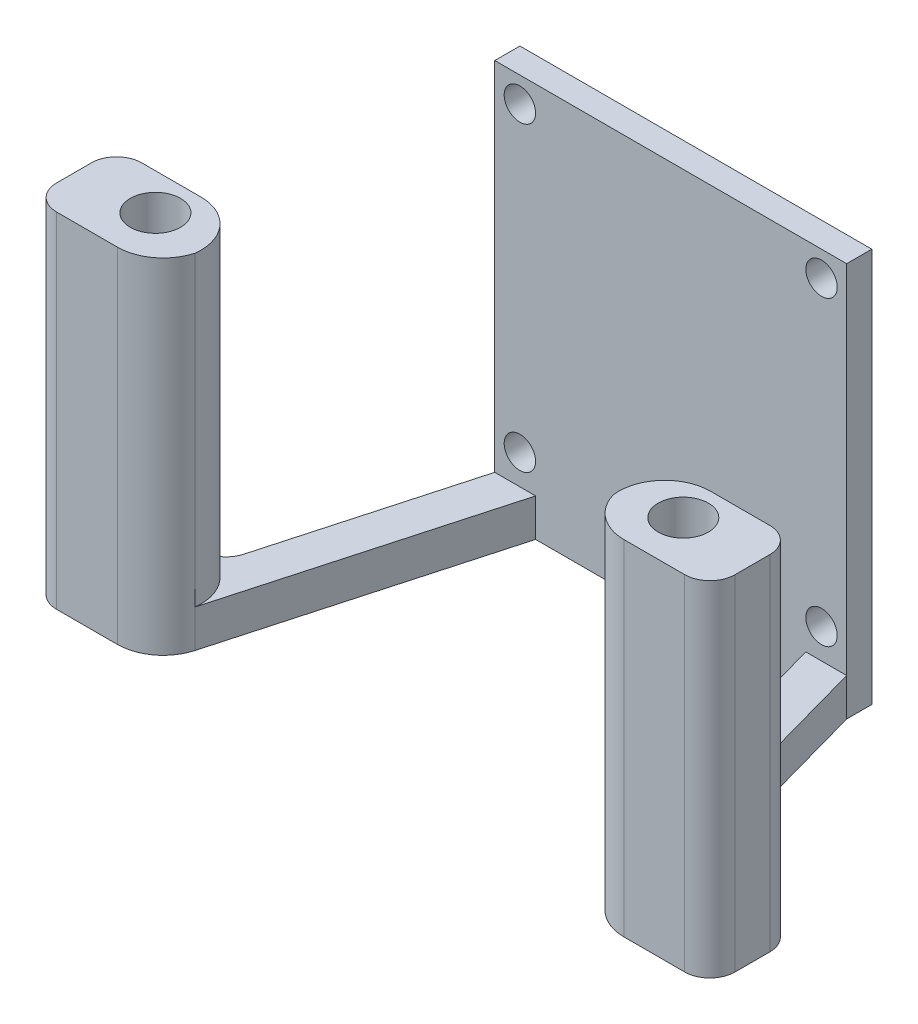
ISO-10303-21;
HEADER;
FILE_DESCRIPTION(('STEP AP214'),'2;1');
FILE_NAME('part.step','',(''),(''),'','','');
FILE_SCHEMA(('AUTOMOTIVE_DESIGN { 1 0 10303 214 1 1 1 1 }'));
ENDSEC;
DATA;
#1=APPLICATION_CONTEXT('core data for automotive mechanical design processes');
#2=APPLICATION_PROTOCOL_DEFINITION('international standard','automotive_design',2000,#1);
#3=PRODUCT_CONTEXT('',#1,'mechanical');
#4=PRODUCT('Part','Part','',(#3));
#5=PRODUCT_RELATED_PRODUCT_CATEGORY('part','',(#4));
#6=PRODUCT_DEFINITION_FORMATION('','',#4);
#7=PRODUCT_DEFINITION_CONTEXT('part definition',#1,'design');
#8=PRODUCT_DEFINITION('design','',#6,#7);
#9=PRODUCT_DEFINITION_SHAPE('','',#8);
#10=(LENGTH_UNIT() NAMED_UNIT(*) SI_UNIT(.MILLI.,.METRE.));
#11=(NAMED_UNIT(*) PLANE_ANGLE_UNIT() SI_UNIT($,.RADIAN.));
#12=(NAMED_UNIT(*) SI_UNIT($,.STERADIAN.) SOLID_ANGLE_UNIT());
#13=UNCERTAINTY_MEASURE_WITH_UNIT(LENGTH_MEASURE(1.E-05),#10,'distance_accuracy_value','');
#14=(GEOMETRIC_REPRESENTATION_CONTEXT(3) GLOBAL_UNCERTAINTY_ASSIGNED_CONTEXT((#13)) GLOBAL_UNIT_ASSIGNED_CONTEXT((#10,
#11,#12)) REPRESENTATION_CONTEXT('',''));
#15=CARTESIAN_POINT('',(0.,0.,0.));
#16=DIRECTION('',(0.,0.,1.));
#17=DIRECTION('',(1.,0.,0.));
#18=AXIS2_PLACEMENT_3D('',#15,#16,#17);
#19=CARTESIAN_POINT('',(20.2723691911253,-14.3761985054046,19.0980908828696));
#20=DIRECTION('',(0.,-1.,0.));
#21=DIRECTION('',(0.,0.,-1.));
#22=AXIS2_PLACEMENT_3D('',#19,#20,#21);
#23=PLANE('',#22);
#24=CARTESIAN_POINT('',(20.2723691911253,-14.3761985054046,24.7551831400172));
#25=DIRECTION('',(0.,-1.,0.));
#26=DIRECTION('',(0.,0.,1.));
#27=AXIS2_PLACEMENT_3D('',#24,#25,#26);
#28=CIRCLE('',#27,3.65709225714755);
#29=CARTESIAN_POINT('',(20.2723691911253,-14.3761985054046,21.0980908828696));
#30=VERTEX_POINT('',#29);
#31=CARTESIAN_POINT('',(16.6423044998491,-14.3761985054046,25.1989782666676));
#32=VERTEX_POINT('',#31);
#33=EDGE_CURVE('E893',#30,#32,#28,.F.);
#34=ORIENTED_EDGE('',*,*,#33,.F.);
#35=CARTESIAN_POINT('',(20.2723691911253,-14.3761985054046,19.0980908828696));
#36=DIRECTION('',(0.,1.,0.));
#37=DIRECTION('',(0.,0.,-1.));
#38=AXIS2_PLACEMENT_3D('',#35,#36,#37);
#39=CIRCLE('',#38,2.);
#40=CARTESIAN_POINT('',(18.3454201146444,-14.3761985054046,19.6336907863886));
#41=VERTEX_POINT('',#40);
#42=EDGE_CURVE('E783',#41,#30,#39,.T.);
#43=ORIENTED_EDGE('',*,*,#42,.F.);
#44=DIRECTION('',(0.267799951759495,0.,0.963474538240431));
#45=VECTOR('',#44,1.);
#46=CARTESIAN_POINT('',(14.,-14.3761985054046,4.));
#47=LINE('',#46,#45);
#48=CARTESIAN_POINT('',(14.,-14.3761985054046,4.));
#49=VERTEX_POINT('',#48);
#50=EDGE_CURVE('E773',#49,#41,#47,.T.);
#51=ORIENTED_EDGE('',*,*,#50,.F.);
#52=DIRECTION('',(1.,0.,0.));
#53=VECTOR('',#52,1.);
#54=CARTESIAN_POINT('',(10.75,-14.3761985054046,4.));
#55=LINE('',#54,#53);
#56=CARTESIAN_POINT('',(10.75,-14.3761985054046,4.));
#57=VERTEX_POINT('',#56);
#58=EDGE_CURVE('E776',#57,#49,#55,.T.);
#59=ORIENTED_EDGE('',*,*,#58,.F.);
#60=DIRECTION('',(-0.267799951759495,0.,-0.963474538240431));
#61=VECTOR('',#60,1.);
#62=CARTESIAN_POINT('',(10.75,-14.3761985054046,4.));
#63=LINE('',#62,#61);
#64=EDGE_CURVE('E851',#32,#57,#63,.T.);
#65=ORIENTED_EDGE('',*,*,#64,.F.);
#66=EDGE_LOOP('',(#34,#43,#51,#59,#65));
#67=FACE_BOUND('',#66,.T.);
#68=ADVANCED_FACE('F37',(#67),#23,.F.);
#69=CARTESIAN_POINT('',(0.,0.,4.));
#70=DIRECTION('',(0.,0.,1.));
#71=DIRECTION('',(1.,0.,0.));
#72=AXIS2_PLACEMENT_3D('',#69,#70,#71);
#73=PLANE('',#72);
#74=DIRECTION('',(0.,-1.,0.));
#75=VECTOR('',#74,1.);
#76=CARTESIAN_POINT('',(10.75,-14.3761985054046,4.));
#77=LINE('',#76,#75);
#78=CARTESIAN_POINT('',(10.75,-17.3761985054046,4.));
#79=VERTEX_POINT('',#78);
#80=EDGE_CURVE('E61',#57,#79,#77,.T.);
#81=ORIENTED_EDGE('',*,*,#80,.F.);
#82=ORIENTED_EDGE('',*,*,#58,.T.);
#83=DIRECTION('',(0.,1.,0.));
#84=VECTOR('',#83,1.);
#85=CARTESIAN_POINT('',(14.,-17.3761985054046,4.));
#86=LINE('',#85,#84);
#87=CARTESIAN_POINT('',(14.,14.,4.));
#88=VERTEX_POINT('',#87);
#89=EDGE_CURVE('E232',#49,#88,#86,.T.);
#90=ORIENTED_EDGE('',*,*,#89,.T.);
#91=DIRECTION('',(-1.,0.,0.));
#92=VECTOR('',#91,1.);
#93=CARTESIAN_POINT('',(14.,14.,4.));
#94=LINE('',#93,#92);
#95=CARTESIAN_POINT('',(-14.,14.,4.));
#96=VERTEX_POINT('',#95);
#97=EDGE_CURVE('E228',#88,#96,#94,.T.);
#98=ORIENTED_EDGE('',*,*,#97,.T.);
#99=DIRECTION('',(0.,-1.,0.));
#100=VECTOR('',#99,1.);
#101=CARTESIAN_POINT('',(-14.,14.,4.));
#102=LINE('',#101,#100);
#103=CARTESIAN_POINT('',(-14.,-14.3761985054046,4.));
#104=VERTEX_POINT('',#103);
#105=EDGE_CURVE('E223',#96,#104,#102,.T.);
#106=ORIENTED_EDGE('',*,*,#105,.T.);
#107=DIRECTION('',(-1.,0.,0.));
#108=VECTOR('',#107,1.);
#109=CARTESIAN_POINT('',(-10.75,-14.3761985054046,4.));
#110=LINE('',#109,#108);
#111=CARTESIAN_POINT('',(-10.75,-14.3761985054046,4.));
#112=VERTEX_POINT('',#111);
#113=EDGE_CURVE('E267',#112,#104,#110,.T.);
#114=ORIENTED_EDGE('',*,*,#113,.F.);
#115=DIRECTION('',(0.,-1.,0.));
#116=VECTOR('',#115,1.);
#117=CARTESIAN_POINT('',(-10.75,-14.3761985054046,4.));
#118=LINE('',#117,#116);
#119=CARTESIAN_POINT('',(-10.75,-17.3761985054046,4.));
#120=VERTEX_POINT('',#119);
#121=EDGE_CURVE('E285',#112,#120,#118,.T.);
#122=ORIENTED_EDGE('',*,*,#121,.T.);
#123=DIRECTION('',(1.,0.,0.));
#124=VECTOR('',#123,1.);
#125=CARTESIAN_POINT('',(-14.,-17.3761985054046,4.));
#126=LINE('',#125,#124);
#127=EDGE_CURVE('E227',#120,#79,#126,.T.);
#128=ORIENTED_EDGE('',*,*,#127,.T.);
#129=EDGE_LOOP('',(#81,#82,#90,#98,#106,#114,#122,#128));
#130=FACE_BOUND('',#129,.T.);
#131=CARTESIAN_POINT('',(12.0000000000001,11.9999999999999,4.));
#132=DIRECTION('',(0.,0.,1.));
#133=DIRECTION('',(1.,0.,0.));
#134=AXIS2_PLACEMENT_3D('',#131,#132,#133);
#135=CIRCLE('',#134,1.24999999999999);
#136=CARTESIAN_POINT('',(13.2500000000001,11.9999999999999,4.));
#137=VERTEX_POINT('',#136);
#138=EDGE_CURVE('E314',#137,#137,#135,.T.);
#139=ORIENTED_EDGE('',*,*,#138,.F.);
#140=EDGE_LOOP('',(#139));
#141=FACE_BOUND('',#140,.T.);
#142=CARTESIAN_POINT('',(-12.,-12.,4.));
#143=DIRECTION('',(0.,0.,1.));
#144=DIRECTION('',(1.,0.,0.));
#145=AXIS2_PLACEMENT_3D('',#142,#143,#144);
#146=CIRCLE('',#145,1.24999999999999);
#147=CARTESIAN_POINT('',(-10.7500000000001,-12.,4.));
#148=VERTEX_POINT('',#147);
#149=EDGE_CURVE('E233',#148,#148,#146,.T.);
#150=ORIENTED_EDGE('',*,*,#149,.F.);
#151=EDGE_LOOP('',(#150));
#152=FACE_BOUND('',#151,.T.);
#153=CARTESIAN_POINT('',(-12.,12.,4.));
#154=DIRECTION('',(0.,0.,1.));
#155=DIRECTION('',(1.,0.,0.));
#156=AXIS2_PLACEMENT_3D('',#153,#154,#155);
#157=CIRCLE('',#156,1.24999999999999);
#158=CARTESIAN_POINT('',(-10.75,12.,4.));
#159=VERTEX_POINT('',#158);
#160=EDGE_CURVE('E236',#159,#159,#157,.T.);
#161=ORIENTED_EDGE('',*,*,#160,.F.);
#162=EDGE_LOOP('',(#161));
#163=FACE_BOUND('',#162,.T.);
#164=CARTESIAN_POINT('',(12.,-12.,4.));
#165=DIRECTION('',(0.,0.,1.));
#166=DIRECTION('',(1.,0.,0.));
#167=AXIS2_PLACEMENT_3D('',#164,#165,#166);
#168=CIRCLE('',#167,1.24999999999999);
#169=CARTESIAN_POINT('',(13.25,-12.,4.));
#170=VERTEX_POINT('',#169);
#171=EDGE_CURVE('E311',#170,#170,#168,.T.);
#172=ORIENTED_EDGE('',*,*,#171,.F.);
#173=EDGE_LOOP('',(#172));
#174=FACE_BOUND('',#173,.T.);
#175=ADVANCED_FACE('F230',(#130,#141,#152,#163,#174),#73,.T.);
#176=CARTESIAN_POINT('',(14.,14.,4.));
#177=DIRECTION('',(0.,-1.,0.));
#178=DIRECTION('',(0.,0.,-1.));
#179=AXIS2_PLACEMENT_3D('',#176,#177,#178);
#180=PLANE('',#179);
#181=DIRECTION('',(0.,0.,-1.));
#182=VECTOR('',#181,1.);
#183=CARTESIAN_POINT('',(14.,14.,4.));
#184=LINE('',#183,#182);
#185=CARTESIAN_POINT('',(14.,14.,2.));
#186=VERTEX_POINT('',#185);
#187=EDGE_CURVE('E218',#88,#186,#184,.T.);
#188=ORIENTED_EDGE('',*,*,#187,.T.);
#189=DIRECTION('',(1.,0.,0.));
#190=VECTOR('',#189,1.);
#191=CARTESIAN_POINT('',(0.,14.,2.));
#192=LINE('',#191,#190);
#193=CARTESIAN_POINT('',(-14.,14.,2.));
#194=VERTEX_POINT('',#193);
#195=EDGE_CURVE('E53',#194,#186,#192,.T.);
#196=ORIENTED_EDGE('',*,*,#195,.F.);
#197=DIRECTION('',(0.,0.,-1.));
#198=VECTOR('',#197,1.);
#199=CARTESIAN_POINT('',(-14.,14.,4.));
#200=LINE('',#199,#198);
#201=EDGE_CURVE('E11',#96,#194,#200,.T.);
#202=ORIENTED_EDGE('',*,*,#201,.F.);
#203=ORIENTED_EDGE('',*,*,#97,.F.);
#204=EDGE_LOOP('',(#188,#196,#202,#203));
#205=FACE_BOUND('',#204,.T.);
#206=ADVANCED_FACE('F39',(#205),#180,.F.);
#207=CARTESIAN_POINT('',(-14.,14.,4.));
#208=DIRECTION('',(1.,0.,0.));
#209=DIRECTION('',(0.,0.,-1.));
#210=AXIS2_PLACEMENT_3D('',#207,#208,#209);
#211=PLANE('',#210);
#212=ORIENTED_EDGE('',*,*,#201,.T.);
#213=DIRECTION('',(0.,1.,0.));
#214=VECTOR('',#213,1.);
#215=CARTESIAN_POINT('',(-14.,-58.,2.));
#216=LINE('',#215,#214);
#217=CARTESIAN_POINT('',(-14.,-17.3761985054046,2.));
#218=VERTEX_POINT('',#217);
#219=EDGE_CURVE('E204',#218,#194,#216,.T.);
#220=ORIENTED_EDGE('',*,*,#219,.F.);
#221=DIRECTION('',(0.,0.,-1.));
#222=VECTOR('',#221,1.);
#223=CARTESIAN_POINT('',(-14.,-17.3761985054046,4.));
#224=LINE('',#223,#222);
#225=CARTESIAN_POINT('',(-14.,-17.3761985054046,4.));
#226=VERTEX_POINT('',#225);
#227=EDGE_CURVE('E46',#226,#218,#224,.T.);
#228=ORIENTED_EDGE('',*,*,#227,.F.);
#229=DIRECTION('',(0.,-1.,0.));
#230=VECTOR('',#229,1.);
#231=CARTESIAN_POINT('',(-14.,-14.3761985054046,4.));
#232=LINE('',#231,#230);
#233=EDGE_CURVE('E225',#104,#226,#232,.T.);
#234=ORIENTED_EDGE('',*,*,#233,.F.);
#235=ORIENTED_EDGE('',*,*,#105,.F.);
#236=EDGE_LOOP('',(#212,#220,#228,#234,#235));
#237=FACE_BOUND('',#236,.T.);
#238=ADVANCED_FACE('F220',(#237),#211,.F.);
#239=CARTESIAN_POINT('',(-14.,-17.3761985054046,4.));
#240=DIRECTION('',(0.,1.,0.));
#241=DIRECTION('',(0.,0.,1.));
#242=AXIS2_PLACEMENT_3D('',#239,#240,#241);
#243=PLANE('',#242);
#244=ORIENTED_EDGE('',*,*,#227,.T.);
#245=DIRECTION('',(1.,0.,0.));
#246=VECTOR('',#245,1.);
#247=CARTESIAN_POINT('',(-14.,-17.3761985054046,2.));
#248=LINE('',#247,#246);
#249=CARTESIAN_POINT('',(14.,-17.3761985054046,2.));
#250=VERTEX_POINT('',#249);
#251=EDGE_CURVE('E207',#218,#250,#248,.T.);
#252=ORIENTED_EDGE('',*,*,#251,.T.);
#253=DIRECTION('',(0.,0.,-1.));
#254=VECTOR('',#253,1.);
#255=CARTESIAN_POINT('',(14.,-17.3761985054046,4.));
#256=LINE('',#255,#254);
#257=CARTESIAN_POINT('',(14.,-17.3761985054046,4.));
#258=VERTEX_POINT('',#257);
#259=EDGE_CURVE('E245',#258,#250,#256,.T.);
#260=ORIENTED_EDGE('',*,*,#259,.F.);
#261=DIRECTION('',(0.267799951759495,0.,0.963474538240431));
#262=VECTOR('',#261,1.);
#263=CARTESIAN_POINT('',(14.,-17.3761985054046,4.));
#264=LINE('',#263,#262);
#265=CARTESIAN_POINT('',(18.3454201146444,-17.3761985054046,19.6336907863886));
#266=VERTEX_POINT('',#265);
#267=EDGE_CURVE('E760',#258,#266,#264,.T.);
#268=ORIENTED_EDGE('',*,*,#267,.T.);
#269=CARTESIAN_POINT('',(20.2723691911253,-17.3761985054046,19.0980908828696));
#270=DIRECTION('',(0.,1.,0.));
#271=DIRECTION('',(0.,0.,-1.));
#272=AXIS2_PLACEMENT_3D('',#269,#270,#271);
#273=CIRCLE('',#272,2.);
#274=CARTESIAN_POINT('',(20.2723691911253,-17.3761985054046,21.0980908828696));
#275=VERTEX_POINT('',#274);
#276=EDGE_CURVE('E763',#266,#275,#273,.T.);
#277=ORIENTED_EDGE('',*,*,#276,.T.);
#278=DIRECTION('',(1.,0.,0.));
#279=VECTOR('',#278,1.);
#280=CARTESIAN_POINT('',(20.2723691911253,-17.3761985054046,21.0980908828696));
#281=LINE('',#280,#279);
#282=CARTESIAN_POINT('',(24.991319672102,-17.3761985054046,21.0980908828696));
#283=VERTEX_POINT('',#282);
#284=EDGE_CURVE('E774',#275,#283,#281,.T.);
#285=ORIENTED_EDGE('',*,*,#284,.T.);
#286=CARTESIAN_POINT('',(24.991319672102,-17.3761985054046,23.0980908828696));
#287=DIRECTION('',(0.,-1.,0.));
#288=DIRECTION('',(0.,0.,-1.));
#289=AXIS2_PLACEMENT_3D('',#286,#287,#288);
#290=CIRCLE('',#289,2.);
#291=CARTESIAN_POINT('',(26.991319672102,-17.3761985054046,23.0980908828696));
#292=VERTEX_POINT('',#291);
#293=EDGE_CURVE('E778',#283,#292,#290,.T.);
#294=ORIENTED_EDGE('',*,*,#293,.T.);
#295=DIRECTION('',(0.,0.,1.));
#296=VECTOR('',#295,1.);
#297=CARTESIAN_POINT('',(26.991319672102,-17.3761985054046,25.8735070913354));
#298=LINE('',#297,#296);
#299=CARTESIAN_POINT('',(26.991319672102,-17.3761985054046,25.8735070913354));
#300=VERTEX_POINT('',#299);
#301=EDGE_CURVE('E865',#292,#300,#298,.T.);
#302=ORIENTED_EDGE('',*,*,#301,.T.);
#303=CARTESIAN_POINT('',(24.991319672102,-17.3761985054046,25.8735070913354));
#304=DIRECTION('',(0.,-1.,0.));
#305=DIRECTION('',(0.,0.,1.));
#306=AXIS2_PLACEMENT_3D('',#303,#304,#305);
#307=CIRCLE('',#306,2.);
#308=CARTESIAN_POINT('',(24.991319672102,-17.3761985054046,27.8735070913354));
#309=VERTEX_POINT('',#308);
#310=EDGE_CURVE('E862',#300,#309,#307,.T.);
#311=ORIENTED_EDGE('',*,*,#310,.T.);
#312=DIRECTION('',(-1.,0.,0.));
#313=VECTOR('',#312,1.);
#314=CARTESIAN_POINT('',(20.1397726508116,-17.3761985054046,27.8735070913354));
#315=LINE('',#314,#313);
#316=CARTESIAN_POINT('',(20.1397726508116,-17.3761985054046,27.8735070913354));
#317=VERTEX_POINT('',#316);
#318=EDGE_CURVE('E859',#309,#317,#315,.T.);
#319=ORIENTED_EDGE('',*,*,#318,.T.);
#320=CARTESIAN_POINT('',(20.1617031379207,-17.3761985054046,24.2207533649289));
#321=DIRECTION('',(0.,-1.,0.));
#322=DIRECTION('',(0.,0.,-1.));
#323=AXIS2_PLACEMENT_3D('',#320,#321,#322);
#324=CIRCLE('',#323,3.65281955919559);
#325=CARTESIAN_POINT('',(16.6423044998491,-17.3761985054046,25.1989782666676));
#326=VERTEX_POINT('',#325);
#327=EDGE_CURVE('E857',#317,#326,#324,.T.);
#328=ORIENTED_EDGE('',*,*,#327,.T.);
#329=DIRECTION('',(-0.267799951759495,0.,-0.963474538240431));
#330=VECTOR('',#329,1.);
#331=CARTESIAN_POINT('',(10.75,-17.3761985054046,4.));
#332=LINE('',#331,#330);
#333=EDGE_CURVE('E764',#326,#79,#332,.T.);
#334=ORIENTED_EDGE('',*,*,#333,.T.);
#335=ORIENTED_EDGE('',*,*,#127,.F.);
#336=DIRECTION('',(0.267799951759495,0.,-0.963474538240431));
#337=VECTOR('',#336,1.);
#338=CARTESIAN_POINT('',(-10.75,-17.3761985054046,4.));
#339=LINE('',#338,#337);
#340=CARTESIAN_POINT('',(-16.6423044998491,-17.3761985054046,25.1989782666676));
#341=VERTEX_POINT('',#340);
#342=EDGE_CURVE('E281',#341,#120,#339,.T.);
#343=ORIENTED_EDGE('',*,*,#342,.F.);
#344=CARTESIAN_POINT('',(-20.1617031379207,-17.3761985054046,24.2207533649289));
#345=DIRECTION('',(0.,1.,0.));
#346=DIRECTION('',(0.,0.,-1.));
#347=AXIS2_PLACEMENT_3D('',#344,#345,#346);
#348=CIRCLE('',#347,3.65281955919559);
#349=CARTESIAN_POINT('',(-20.1397726508116,-17.3761985054046,27.8735070913354));
#350=VERTEX_POINT('',#349);
#351=EDGE_CURVE('E279',#350,#341,#348,.T.);
#352=ORIENTED_EDGE('',*,*,#351,.F.);
#353=DIRECTION('',(1.,0.,0.));
#354=VECTOR('',#353,1.);
#355=CARTESIAN_POINT('',(-20.1397726508116,-17.3761985054046,27.8735070913354));
#356=LINE('',#355,#354);
#357=CARTESIAN_POINT('',(-24.991319672102,-17.3761985054046,27.8735070913354));
#358=VERTEX_POINT('',#357);
#359=EDGE_CURVE('E277',#358,#350,#356,.T.);
#360=ORIENTED_EDGE('',*,*,#359,.F.);
#361=CARTESIAN_POINT('',(-24.991319672102,-17.3761985054046,25.8735070913354));
#362=DIRECTION('',(0.,1.,0.));
#363=DIRECTION('',(0.,0.,1.));
#364=AXIS2_PLACEMENT_3D('',#361,#362,#363);
#365=CIRCLE('',#364,2.);
#366=CARTESIAN_POINT('',(-26.991319672102,-17.3761985054046,25.8735070913354));
#367=VERTEX_POINT('',#366);
#368=EDGE_CURVE('E275',#367,#358,#365,.T.);
#369=ORIENTED_EDGE('',*,*,#368,.F.);
#370=DIRECTION('',(0.,0.,1.));
#371=VECTOR('',#370,1.);
#372=CARTESIAN_POINT('',(-26.991319672102,-17.3761985054046,25.8735070913354));
#373=LINE('',#372,#371);
#374=CARTESIAN_POINT('',(-26.991319672102,-17.3761985054046,23.0980908828696));
#375=VERTEX_POINT('',#374);
#376=EDGE_CURVE('E273',#375,#367,#373,.T.);
#377=ORIENTED_EDGE('',*,*,#376,.F.);
#378=CARTESIAN_POINT('',(-24.991319672102,-17.3761985054046,23.0980908828696));
#379=DIRECTION('',(0.,1.,0.));
#380=DIRECTION('',(0.,0.,-1.));
#381=AXIS2_PLACEMENT_3D('',#378,#379,#380);
#382=CIRCLE('',#381,2.);
#383=CARTESIAN_POINT('',(-24.991319672102,-17.3761985054046,21.0980908828696));
#384=VERTEX_POINT('',#383);
#385=EDGE_CURVE('E271',#384,#375,#382,.T.);
#386=ORIENTED_EDGE('',*,*,#385,.F.);
#387=DIRECTION('',(-1.,0.,0.));
#388=VECTOR('',#387,1.);
#389=CARTESIAN_POINT('',(-20.2723691911253,-17.3761985054046,21.0980908828696));
#390=LINE('',#389,#388);
#391=CARTESIAN_POINT('',(-20.2723691911253,-17.3761985054046,21.0980908828696));
#392=VERTEX_POINT('',#391);
#393=EDGE_CURVE('E261',#392,#384,#390,.T.);
#394=ORIENTED_EDGE('',*,*,#393,.F.);
#395=CARTESIAN_POINT('',(-20.2723691911253,-17.3761985054046,19.0980908828696));
#396=DIRECTION('',(0.,-1.,0.));
#397=DIRECTION('',(0.,0.,-1.));
#398=AXIS2_PLACEMENT_3D('',#395,#396,#397);
#399=CIRCLE('',#398,2.);
#400=CARTESIAN_POINT('',(-18.3454201146444,-17.3761985054046,19.6336907863886));
#401=VERTEX_POINT('',#400);
#402=EDGE_CURVE('E255',#401,#392,#399,.T.);
#403=ORIENTED_EDGE('',*,*,#402,.F.);
#404=DIRECTION('',(-0.267799951759495,0.,0.963474538240431));
#405=VECTOR('',#404,1.);
#406=CARTESIAN_POINT('',(-14.,-17.3761985054046,4.));
#407=LINE('',#406,#405);
#408=EDGE_CURVE('E253',#226,#401,#407,.T.);
#409=ORIENTED_EDGE('',*,*,#408,.F.);
#410=EDGE_LOOP('',(#244,#252,#260,#268,#277,#285,#294,#302,#311,#319,#328,#334,#335,#343,#352,
#360,#369,#377,#386,#394,#403,#409));
#411=FACE_BOUND('',#410,.T.);
#412=CARTESIAN_POINT('',(-21.,-17.3761985054046,24.));
#413=DIRECTION('',(0.,1.,0.));
#414=DIRECTION('',(0.,0.,1.));
#415=AXIS2_PLACEMENT_3D('',#412,#413,#414);
#416=CIRCLE('',#415,2.);
#417=CARTESIAN_POINT('',(-21.,-17.3761985054046,26.));
#418=VERTEX_POINT('',#417);
#419=EDGE_CURVE('E259',#418,#418,#416,.T.);
#420=ORIENTED_EDGE('',*,*,#419,.T.);
#421=EDGE_LOOP('',(#420));
#422=FACE_BOUND('',#421,.T.);
#423=CARTESIAN_POINT('',(21.,-17.3761985054046,24.));
#424=DIRECTION('',(0.,-1.,0.));
#425=DIRECTION('',(0.,0.,1.));
#426=AXIS2_PLACEMENT_3D('',#423,#424,#425);
#427=CIRCLE('',#426,2.);
#428=CARTESIAN_POINT('',(21.,-17.3761985054046,26.));
#429=VERTEX_POINT('',#428);
#430=EDGE_CURVE('E765',#429,#429,#427,.T.);
#431=ORIENTED_EDGE('',*,*,#430,.F.);
#432=EDGE_LOOP('',(#431));
#433=FACE_BOUND('',#432,.T.);
#434=ADVANCED_FACE('F250',(#411,#422,#433),#243,.F.);
#435=CARTESIAN_POINT('',(14.,-17.3761985054046,4.));
#436=DIRECTION('',(-1.,0.,0.));
#437=DIRECTION('',(0.,-1.,0.));
#438=AXIS2_PLACEMENT_3D('',#435,#436,#437);
#439=PLANE('',#438);
#440=ORIENTED_EDGE('',*,*,#259,.T.);
#441=DIRECTION('',(0.,1.,0.));
#442=VECTOR('',#441,1.);
#443=CARTESIAN_POINT('',(14.,-58.,2.));
#444=LINE('',#443,#442);
#445=EDGE_CURVE('E211',#250,#186,#444,.T.);
#446=ORIENTED_EDGE('',*,*,#445,.T.);
#447=ORIENTED_EDGE('',*,*,#187,.F.);
#448=ORIENTED_EDGE('',*,*,#89,.F.);
#449=EDGE_CURVE('E241',#258,#49,#86,.T.);
#450=ORIENTED_EDGE('',*,*,#449,.F.);
#451=EDGE_LOOP('',(#440,#446,#447,#448,#450));
#452=FACE_BOUND('',#451,.T.);
#453=ADVANCED_FACE('F577',(#452),#439,.F.);
#454=CARTESIAN_POINT('',(-12.,-12.,4.));
#455=DIRECTION('',(0.,0.,-1.));
#456=DIRECTION('',(-1.,0.,0.));
#457=AXIS2_PLACEMENT_3D('',#454,#455,#456);
#458=CYLINDRICAL_SURFACE('',#457,1.24999999999999);
#459=CARTESIAN_POINT('',(-12.,-12.,2.));
#460=DIRECTION('',(0.,0.,1.));
#461=DIRECTION('',(1.,0.,0.));
#462=AXIS2_PLACEMENT_3D('',#459,#460,#461);
#463=CIRCLE('',#462,1.24999999999999);
#464=CARTESIAN_POINT('',(-10.7500000000001,-12.,2.));
#465=VERTEX_POINT('',#464);
#466=EDGE_CURVE('E898',#465,#465,#463,.T.);
#467=ORIENTED_EDGE('',*,*,#466,.F.);
#468=EDGE_LOOP('',(#467));
#469=FACE_BOUND('',#468,.T.);
#470=ORIENTED_EDGE('',*,*,#149,.T.);
#471=EDGE_LOOP('',(#470));
#472=FACE_BOUND('',#471,.T.);
#473=ADVANCED_FACE('F567',(#469,#472),#458,.F.);
#474=CARTESIAN_POINT('',(-12.,12.,4.));
#475=DIRECTION('',(0.,0.,-1.));
#476=DIRECTION('',(-1.,0.,0.));
#477=AXIS2_PLACEMENT_3D('',#474,#475,#476);
#478=CYLINDRICAL_SURFACE('',#477,1.24999999999999);
#479=CARTESIAN_POINT('',(-12.,12.,2.));
#480=DIRECTION('',(0.,0.,1.));
#481=DIRECTION('',(1.,0.,0.));
#482=AXIS2_PLACEMENT_3D('',#479,#480,#481);
#483=CIRCLE('',#482,1.24999999999999);
#484=CARTESIAN_POINT('',(-10.75,12.,2.));
#485=VERTEX_POINT('',#484);
#486=EDGE_CURVE('E924',#485,#485,#483,.T.);
#487=ORIENTED_EDGE('',*,*,#486,.F.);
#488=EDGE_LOOP('',(#487));
#489=FACE_BOUND('',#488,.T.);
#490=ORIENTED_EDGE('',*,*,#160,.T.);
#491=EDGE_LOOP('',(#490));
#492=FACE_BOUND('',#491,.T.);
#493=ADVANCED_FACE('F319',(#489,#492),#478,.F.);
#494=CARTESIAN_POINT('',(12.0000000000001,11.9999999999999,4.));
#495=DIRECTION('',(0.,0.,-1.));
#496=DIRECTION('',(-1.,0.,0.));
#497=AXIS2_PLACEMENT_3D('',#494,#495,#496);
#498=CYLINDRICAL_SURFACE('',#497,1.24999999999999);
#499=CARTESIAN_POINT('',(12.0000000000001,11.9999999999999,2.));
#500=DIRECTION('',(0.,0.,1.));
#501=DIRECTION('',(1.,0.,0.));
#502=AXIS2_PLACEMENT_3D('',#499,#500,#501);
#503=CIRCLE('',#502,1.24999999999999);
#504=CARTESIAN_POINT('',(13.2500000000001,11.9999999999999,2.));
#505=VERTEX_POINT('',#504);
#506=EDGE_CURVE('E927',#505,#505,#503,.T.);
#507=ORIENTED_EDGE('',*,*,#506,.F.);
#508=EDGE_LOOP('',(#507));
#509=FACE_BOUND('',#508,.T.);
#510=ORIENTED_EDGE('',*,*,#138,.T.);
#511=EDGE_LOOP('',(#510));
#512=FACE_BOUND('',#511,.T.);
#513=ADVANCED_FACE('F329',(#509,#512),#498,.F.);
#514=CARTESIAN_POINT('',(12.,-12.,4.));
#515=DIRECTION('',(0.,0.,-1.));
#516=DIRECTION('',(-1.,0.,0.));
#517=AXIS2_PLACEMENT_3D('',#514,#515,#516);
#518=CYLINDRICAL_SURFACE('',#517,1.24999999999999);
#519=CARTESIAN_POINT('',(12.,-12.,2.));
#520=DIRECTION('',(0.,0.,1.));
#521=DIRECTION('',(1.,0.,0.));
#522=AXIS2_PLACEMENT_3D('',#519,#520,#521);
#523=CIRCLE('',#522,1.24999999999999);
#524=CARTESIAN_POINT('',(13.25,-12.,2.));
#525=VERTEX_POINT('',#524);
#526=EDGE_CURVE('E41',#525,#525,#523,.T.);
#527=ORIENTED_EDGE('',*,*,#526,.F.);
#528=EDGE_LOOP('',(#527));
#529=FACE_BOUND('',#528,.T.);
#530=ORIENTED_EDGE('',*,*,#171,.T.);
#531=EDGE_LOOP('',(#530));
#532=FACE_BOUND('',#531,.T.);
#533=ADVANCED_FACE('F326',(#529,#532),#518,.F.);
#534=CARTESIAN_POINT('',(-20.2723691911253,-14.3761985054046,19.0980908828696));
#535=DIRECTION('',(0.,-1.,0.));
#536=DIRECTION('',(0.,0.,-1.));
#537=AXIS2_PLACEMENT_3D('',#534,#535,#536);
#538=PLANE('',#537);
#539=CARTESIAN_POINT('',(-20.2723691911253,-14.3761985054046,19.0980908828696));
#540=DIRECTION('',(0.,-1.,0.));
#541=DIRECTION('',(0.,0.,-1.));
#542=AXIS2_PLACEMENT_3D('',#539,#540,#541);
#543=CIRCLE('',#542,2.);
#544=CARTESIAN_POINT('',(-18.3454201146444,-14.3761985054046,19.6336907863886));
#545=VERTEX_POINT('',#544);
#546=CARTESIAN_POINT('',(-20.2723691911253,-14.3761985054046,21.0980908828696));
#547=VERTEX_POINT('',#546);
#548=EDGE_CURVE('E831',#545,#547,#543,.T.);
#549=ORIENTED_EDGE('',*,*,#548,.T.);
#550=CARTESIAN_POINT('',(-20.2723691911253,-14.3761985054046,24.7551831400172));
#551=DIRECTION('',(0.,1.,0.));
#552=DIRECTION('',(0.,0.,1.));
#553=AXIS2_PLACEMENT_3D('',#550,#551,#552);
#554=CIRCLE('',#553,3.65709225714755);
#555=CARTESIAN_POINT('',(-16.6423044998491,-14.3761985054046,25.1989782666676));
#556=VERTEX_POINT('',#555);
#557=EDGE_CURVE('E798',#547,#556,#554,.F.);
#558=ORIENTED_EDGE('',*,*,#557,.T.);
#559=DIRECTION('',(0.267799951759495,0.,-0.963474538240431));
#560=VECTOR('',#559,1.);
#561=CARTESIAN_POINT('',(-10.75,-14.3761985054046,4.));
#562=LINE('',#561,#560);
#563=EDGE_CURVE('E832',#556,#112,#562,.T.);
#564=ORIENTED_EDGE('',*,*,#563,.T.);
#565=ORIENTED_EDGE('',*,*,#113,.T.);
#566=DIRECTION('',(-0.267799951759495,0.,0.963474538240431));
#567=VECTOR('',#566,1.);
#568=CARTESIAN_POINT('',(-14.,-14.3761985054046,4.));
#569=LINE('',#568,#567);
#570=EDGE_CURVE('E283',#104,#545,#569,.T.);
#571=ORIENTED_EDGE('',*,*,#570,.T.);
#572=EDGE_LOOP('',(#549,#558,#564,#565,#571));
#573=FACE_BOUND('',#572,.T.);
#574=ADVANCED_FACE('F328',(#573),#538,.F.);
#575=CARTESIAN_POINT('',(-14.,-14.3761985054046,4.));
#576=DIRECTION('',(0.963474538240431,0.,0.267799951759495));
#577=DIRECTION('',(0.267799951759495,0.,-0.963474538240431));
#578=AXIS2_PLACEMENT_3D('',#575,#576,#577);
#579=PLANE('',#578);
#580=ORIENTED_EDGE('',*,*,#408,.T.);
#581=DIRECTION('',(0.,-1.,0.));
#582=VECTOR('',#581,1.);
#583=CARTESIAN_POINT('',(-18.3454201146444,-14.3761985054046,19.6336907863886));
#584=LINE('',#583,#582);
#585=EDGE_CURVE('E309',#545,#401,#584,.T.);
#586=ORIENTED_EDGE('',*,*,#585,.F.);
#587=ORIENTED_EDGE('',*,*,#570,.F.);
#588=ORIENTED_EDGE('',*,*,#233,.T.);
#589=EDGE_LOOP('',(#580,#586,#587,#588));
#590=FACE_BOUND('',#589,.T.);
#591=ADVANCED_FACE('F336',(#590),#579,.F.);
#592=CARTESIAN_POINT('',(-20.2723691911253,-14.3761985054046,19.0980908828696));
#593=DIRECTION('',(0.,-1.,0.));
#594=DIRECTION('',(0.,0.,-1.));
#595=AXIS2_PLACEMENT_3D('',#592,#593,#594);
#596=CYLINDRICAL_SURFACE('',#595,2.);
#597=ORIENTED_EDGE('',*,*,#402,.T.);
#598=DIRECTION('',(0.,-1.,0.));
#599=VECTOR('',#598,1.);
#600=CARTESIAN_POINT('',(-20.2723691911253,-14.3761985054046,21.0980908828696));
#601=LINE('',#600,#599);
#602=EDGE_CURVE('E306',#547,#392,#601,.T.);
#603=ORIENTED_EDGE('',*,*,#602,.F.);
#604=ORIENTED_EDGE('',*,*,#548,.F.);
#605=ORIENTED_EDGE('',*,*,#585,.T.);
#606=EDGE_LOOP('',(#597,#603,#604,#605));
#607=FACE_BOUND('',#606,.T.);
#608=ADVANCED_FACE('F428',(#607),#596,.F.);
#609=CARTESIAN_POINT('',(-20.2723691911253,-14.3761985054046,21.0980908828696));
#610=DIRECTION('',(0.,0.,1.));
#611=DIRECTION('',(1.,0.,0.));
#612=AXIS2_PLACEMENT_3D('',#609,#610,#611);
#613=PLANE('',#612);
#614=ORIENTED_EDGE('',*,*,#393,.T.);
#615=DIRECTION('',(0.,-1.,0.));
#616=VECTOR('',#615,1.);
#617=CARTESIAN_POINT('',(-24.991319672102,-14.3761985054046,21.0980908828696));
#618=LINE('',#617,#616);
#619=CARTESIAN_POINT('',(-24.991319672102,10.0038014945954,21.0980908828696));
#620=VERTEX_POINT('',#619);
#621=EDGE_CURVE('E303',#620,#384,#618,.T.);
#622=ORIENTED_EDGE('',*,*,#621,.F.);
#623=DIRECTION('',(-1.,0.,0.));
#624=VECTOR('',#623,1.);
#625=CARTESIAN_POINT('',(0.,10.0038014945954,21.0980908828696));
#626=LINE('',#625,#624);
#627=CARTESIAN_POINT('',(-20.2723691911253,10.0038014945954,21.0980908828696));
#628=VERTEX_POINT('',#627);
#629=EDGE_CURVE('E802',#628,#620,#626,.T.);
#630=ORIENTED_EDGE('',*,*,#629,.F.);
#631=DIRECTION('',(0.,-1.,0.));
#632=VECTOR('',#631,1.);
#633=CARTESIAN_POINT('',(-20.2723691911253,10.0038014945954,21.0980908828696));
#634=LINE('',#633,#632);
#635=EDGE_CURVE('E264',#628,#547,#634,.T.);
#636=ORIENTED_EDGE('',*,*,#635,.T.);
#637=ORIENTED_EDGE('',*,*,#602,.T.);
#638=EDGE_LOOP('',(#614,#622,#630,#636,#637));
#639=FACE_BOUND('',#638,.T.);
#640=ADVANCED_FACE('F424',(#639),#613,.F.);
#641=CARTESIAN_POINT('',(-24.991319672102,-14.3761985054046,23.0980908828696));
#642=DIRECTION('',(0.,-1.,0.));
#643=DIRECTION('',(0.,0.,-1.));
#644=AXIS2_PLACEMENT_3D('',#641,#642,#643);
#645=CYLINDRICAL_SURFACE('',#644,2.);
#646=ORIENTED_EDGE('',*,*,#385,.T.);
#647=DIRECTION('',(0.,-1.,0.));
#648=VECTOR('',#647,1.);
#649=CARTESIAN_POINT('',(-26.991319672102,-14.3761985054046,23.0980908828696));
#650=LINE('',#649,#648);
#651=CARTESIAN_POINT('',(-26.991319672102,10.0038014945954,23.0980908828696));
#652=VERTEX_POINT('',#651);
#653=EDGE_CURVE('E300',#652,#375,#650,.T.);
#654=ORIENTED_EDGE('',*,*,#653,.F.);
#655=CARTESIAN_POINT('',(-24.991319672102,10.0038014945954,23.0980908828696));
#656=DIRECTION('',(0.,1.,0.));
#657=DIRECTION('',(0.,0.,1.));
#658=AXIS2_PLACEMENT_3D('',#655,#656,#657);
#659=CIRCLE('',#658,2.);
#660=EDGE_CURVE('E805',#620,#652,#659,.T.);
#661=ORIENTED_EDGE('',*,*,#660,.F.);
#662=ORIENTED_EDGE('',*,*,#621,.T.);
#663=EDGE_LOOP('',(#646,#654,#661,#662));
#664=FACE_BOUND('',#663,.T.);
#665=ADVANCED_FACE('F420',(#664),#645,.T.);
#666=CARTESIAN_POINT('',(-26.991319672102,-14.3761985054046,25.8735070913354));
#667=DIRECTION('',(1.,0.,0.));
#668=DIRECTION('',(0.,0.,-1.));
#669=AXIS2_PLACEMENT_3D('',#666,#667,#668);
#670=PLANE('',#669);
#671=ORIENTED_EDGE('',*,*,#376,.T.);
#672=DIRECTION('',(0.,-1.,0.));
#673=VECTOR('',#672,1.);
#674=CARTESIAN_POINT('',(-26.991319672102,-14.3761985054046,25.8735070913354));
#675=LINE('',#674,#673);
#676=CARTESIAN_POINT('',(-26.991319672102,10.0038014945954,25.8735070913354));
#677=VERTEX_POINT('',#676);
#678=EDGE_CURVE('E297',#677,#367,#675,.T.);
#679=ORIENTED_EDGE('',*,*,#678,.F.);
#680=DIRECTION('',(0.,0.,1.));
#681=VECTOR('',#680,1.);
#682=CARTESIAN_POINT('',(-26.991319672102,10.0038014945954,0.));
#683=LINE('',#682,#681);
#684=EDGE_CURVE('E808',#652,#677,#683,.T.);
#685=ORIENTED_EDGE('',*,*,#684,.F.);
#686=ORIENTED_EDGE('',*,*,#653,.T.);
#687=EDGE_LOOP('',(#671,#679,#685,#686));
#688=FACE_BOUND('',#687,.T.);
#689=ADVANCED_FACE('F416',(#688),#670,.F.);
#690=CARTESIAN_POINT('',(-24.991319672102,-14.3761985054046,25.8735070913354));
#691=DIRECTION('',(0.,-1.,0.));
#692=DIRECTION('',(0.,0.,-1.));
#693=AXIS2_PLACEMENT_3D('',#690,#691,#692);
#694=CYLINDRICAL_SURFACE('',#693,2.);
#695=ORIENTED_EDGE('',*,*,#368,.T.);
#696=DIRECTION('',(0.,-1.,0.));
#697=VECTOR('',#696,1.);
#698=CARTESIAN_POINT('',(-24.991319672102,-14.3761985054046,27.8735070913354));
#699=LINE('',#698,#697);
#700=CARTESIAN_POINT('',(-24.991319672102,10.0038014945954,27.8735070913354));
#701=VERTEX_POINT('',#700);
#702=EDGE_CURVE('E294',#701,#358,#699,.T.);
#703=ORIENTED_EDGE('',*,*,#702,.F.);
#704=CARTESIAN_POINT('',(-24.991319672102,10.0038014945954,25.8735070913354));
#705=DIRECTION('',(0.,1.,0.));
#706=DIRECTION('',(0.,0.,1.));
#707=AXIS2_PLACEMENT_3D('',#704,#705,#706);
#708=CIRCLE('',#707,2.);
#709=EDGE_CURVE('E811',#677,#701,#708,.T.);
#710=ORIENTED_EDGE('',*,*,#709,.F.);
#711=ORIENTED_EDGE('',*,*,#678,.T.);
#712=EDGE_LOOP('',(#695,#703,#710,#711));
#713=FACE_BOUND('',#712,.T.);
#714=ADVANCED_FACE('F412',(#713),#694,.T.);
#715=CARTESIAN_POINT('',(-20.1397726508116,-14.3761985054046,27.8735070913354));
#716=DIRECTION('',(0.,0.,-1.));
#717=DIRECTION('',(-1.,0.,0.));
#718=AXIS2_PLACEMENT_3D('',#715,#716,#717);
#719=PLANE('',#718);
#720=ORIENTED_EDGE('',*,*,#359,.T.);
#721=DIRECTION('',(0.,-1.,0.));
#722=VECTOR('',#721,1.);
#723=CARTESIAN_POINT('',(-20.1397726508116,-14.3761985054046,27.8735070913354));
#724=LINE('',#723,#722);
#725=CARTESIAN_POINT('',(-20.1397726508116,10.0038014945954,27.8735070913354));
#726=VERTEX_POINT('',#725);
#727=EDGE_CURVE('E291',#726,#350,#724,.T.);
#728=ORIENTED_EDGE('',*,*,#727,.F.);
#729=DIRECTION('',(1.,0.,0.));
#730=VECTOR('',#729,1.);
#731=CARTESIAN_POINT('',(0.,10.0038014945954,27.8735070913354));
#732=LINE('',#731,#730);
#733=EDGE_CURVE('E814',#701,#726,#732,.T.);
#734=ORIENTED_EDGE('',*,*,#733,.F.);
#735=ORIENTED_EDGE('',*,*,#702,.T.);
#736=EDGE_LOOP('',(#720,#728,#734,#735));
#737=FACE_BOUND('',#736,.T.);
#738=ADVANCED_FACE('F408',(#737),#719,.F.);
#739=CARTESIAN_POINT('',(-20.1617031379207,-14.3761985054046,24.2207533649289));
#740=DIRECTION('',(0.,-1.,0.));
#741=DIRECTION('',(0.,0.,-1.));
#742=AXIS2_PLACEMENT_3D('',#739,#740,#741);
#743=CYLINDRICAL_SURFACE('',#742,3.65281955919559);
#744=ORIENTED_EDGE('',*,*,#351,.T.);
#745=DIRECTION('',(0.,-1.,0.));
#746=VECTOR('',#745,1.);
#747=CARTESIAN_POINT('',(-16.6423044998491,-14.3761985054046,25.1989782666676));
#748=LINE('',#747,#746);
#749=EDGE_CURVE('E288',#556,#341,#748,.T.);
#750=ORIENTED_EDGE('',*,*,#749,.F.);
#751=DIRECTION('',(0.,-1.,0.));
#752=VECTOR('',#751,1.);
#753=CARTESIAN_POINT('',(-16.6423044998491,10.0038014945954,25.1989782666676));
#754=LINE('',#753,#752);
#755=CARTESIAN_POINT('',(-16.6423044998491,10.0038014945954,25.1989782666676));
#756=VERTEX_POINT('',#755);
#757=EDGE_CURVE('E822',#756,#556,#754,.T.);
#758=ORIENTED_EDGE('',*,*,#757,.F.);
#759=CARTESIAN_POINT('',(-20.1617031379207,10.0038014945954,24.2207533649289));
#760=DIRECTION('',(0.,1.,0.));
#761=DIRECTION('',(0.,0.,1.));
#762=AXIS2_PLACEMENT_3D('',#759,#760,#761);
#763=CIRCLE('',#762,3.65281955919559);
#764=EDGE_CURVE('E817',#726,#756,#763,.T.);
#765=ORIENTED_EDGE('',*,*,#764,.F.);
#766=ORIENTED_EDGE('',*,*,#727,.T.);
#767=EDGE_LOOP('',(#744,#750,#758,#765,#766));
#768=FACE_BOUND('',#767,.T.);
#769=ADVANCED_FACE('F404',(#768),#743,.T.);
#770=CARTESIAN_POINT('',(-10.75,-14.3761985054046,4.));
#771=DIRECTION('',(-0.963474538240431,0.,-0.267799951759495));
#772=DIRECTION('',(-0.267799951759495,0.,0.963474538240431));
#773=AXIS2_PLACEMENT_3D('',#770,#771,#772);
#774=PLANE('',#773);
#775=ORIENTED_EDGE('',*,*,#342,.T.);
#776=ORIENTED_EDGE('',*,*,#121,.F.);
#777=ORIENTED_EDGE('',*,*,#563,.F.);
#778=ORIENTED_EDGE('',*,*,#749,.T.);
#779=EDGE_LOOP('',(#775,#776,#777,#778));
#780=FACE_BOUND('',#779,.T.);
#781=ADVANCED_FACE('F399',(#780),#774,.F.);
#782=CARTESIAN_POINT('',(-21.,-14.3761985054046,24.));
#783=DIRECTION('',(0.,-1.,0.));
#784=DIRECTION('',(0.,0.,-1.));
#785=AXIS2_PLACEMENT_3D('',#782,#783,#784);
#786=CYLINDRICAL_SURFACE('',#785,2.);
#787=ORIENTED_EDGE('',*,*,#419,.F.);
#788=EDGE_LOOP('',(#787));
#789=FACE_BOUND('',#788,.T.);
#790=CARTESIAN_POINT('',(-21.,10.0038014945954,24.));
#791=DIRECTION('',(0.,1.,0.));
#792=DIRECTION('',(0.,0.,1.));
#793=AXIS2_PLACEMENT_3D('',#790,#791,#792);
#794=CIRCLE('',#793,2.);
#795=CARTESIAN_POINT('',(-21.,10.0038014945954,26.));
#796=VERTEX_POINT('',#795);
#797=EDGE_CURVE('E819',#796,#796,#794,.F.);
#798=ORIENTED_EDGE('',*,*,#797,.F.);
#799=EDGE_LOOP('',(#798));
#800=FACE_BOUND('',#799,.T.);
#801=ADVANCED_FACE('F396',(#789,#800),#786,.F.);
#802=CARTESIAN_POINT('',(-20.2723691911253,10.0038014945954,24.7551831400172));
#803=DIRECTION('',(0.,-1.,0.));
#804=DIRECTION('',(0.,0.,-1.));
#805=AXIS2_PLACEMENT_3D('',#802,#803,#804);
#806=CYLINDRICAL_SURFACE('',#805,3.65709225714755);
#807=ORIENTED_EDGE('',*,*,#557,.F.);
#808=ORIENTED_EDGE('',*,*,#635,.F.);
#809=CARTESIAN_POINT('',(-20.2723691911253,10.0038014945954,24.7551831400172));
#810=DIRECTION('',(0.,1.,0.));
#811=DIRECTION('',(0.,0.,1.));
#812=AXIS2_PLACEMENT_3D('',#809,#810,#811);
#813=CIRCLE('',#812,3.65709225714755);
#814=EDGE_CURVE('E799',#628,#756,#813,.F.);
#815=ORIENTED_EDGE('',*,*,#814,.T.);
#816=ORIENTED_EDGE('',*,*,#757,.T.);
#817=EDGE_LOOP('',(#807,#808,#815,#816));
#818=FACE_BOUND('',#817,.T.);
#819=ADVANCED_FACE('F392',(#818),#806,.T.);
#820=CARTESIAN_POINT('',(0.,10.0038014945954,0.));
#821=DIRECTION('',(0.,1.,0.));
#822=DIRECTION('',(0.,0.,1.));
#823=AXIS2_PLACEMENT_3D('',#820,#821,#822);
#824=PLANE('',#823);
#825=ORIENTED_EDGE('',*,*,#814,.F.);
#826=ORIENTED_EDGE('',*,*,#629,.T.);
#827=ORIENTED_EDGE('',*,*,#660,.T.);
#828=ORIENTED_EDGE('',*,*,#684,.T.);
#829=ORIENTED_EDGE('',*,*,#709,.T.);
#830=ORIENTED_EDGE('',*,*,#733,.T.);
#831=ORIENTED_EDGE('',*,*,#764,.T.);
#832=EDGE_LOOP('',(#825,#826,#827,#828,#829,#830,#831));
#833=FACE_BOUND('',#832,.T.);
#834=ORIENTED_EDGE('',*,*,#797,.T.);
#835=EDGE_LOOP('',(#834));
#836=FACE_BOUND('',#835,.T.);
#837=ADVANCED_FACE('F388',(#833,#836),#824,.T.);
#838=CARTESIAN_POINT('',(14.,-14.3761985054046,4.));
#839=DIRECTION('',(0.963474538240431,0.,-0.267799951759495));
#840=DIRECTION('',(-0.267799951759495,0.,-0.963474538240431));
#841=AXIS2_PLACEMENT_3D('',#838,#839,#840);
#842=PLANE('',#841);
#843=ORIENTED_EDGE('',*,*,#267,.F.);
#844=ORIENTED_EDGE('',*,*,#449,.T.);
#845=ORIENTED_EDGE('',*,*,#50,.T.);
#846=DIRECTION('',(0.,-1.,0.));
#847=VECTOR('',#846,1.);
#848=CARTESIAN_POINT('',(18.3454201146444,-14.3761985054046,19.6336907863886));
#849=LINE('',#848,#847);
#850=EDGE_CURVE('E768',#41,#266,#849,.T.);
#851=ORIENTED_EDGE('',*,*,#850,.T.);
#852=EDGE_LOOP('',(#843,#844,#845,#851));
#853=FACE_BOUND('',#852,.T.);
#854=ADVANCED_FACE('F384',(#853),#842,.T.);
#855=CARTESIAN_POINT('',(10.75,-14.3761985054046,4.));
#856=DIRECTION('',(-0.963474538240431,0.,0.267799951759495));
#857=DIRECTION('',(0.267799951759495,0.,0.963474538240431));
#858=AXIS2_PLACEMENT_3D('',#855,#856,#857);
#859=PLANE('',#858);
#860=ORIENTED_EDGE('',*,*,#333,.F.);
#861=DIRECTION('',(0.,-1.,0.));
#862=VECTOR('',#861,1.);
#863=CARTESIAN_POINT('',(16.6423044998491,-14.3761985054046,25.1989782666676));
#864=LINE('',#863,#862);
#865=EDGE_CURVE('E795',#32,#326,#864,.T.);
#866=ORIENTED_EDGE('',*,*,#865,.F.);
#867=ORIENTED_EDGE('',*,*,#64,.T.);
#868=ORIENTED_EDGE('',*,*,#80,.T.);
#869=EDGE_LOOP('',(#860,#866,#867,#868));
#870=FACE_BOUND('',#869,.T.);
#871=ADVANCED_FACE('F380',(#870),#859,.T.);
#872=CARTESIAN_POINT('',(20.1617031379207,-14.3761985054046,24.2207533649289));
#873=DIRECTION('',(0.,-1.,0.));
#874=DIRECTION('',(0.,0.,-1.));
#875=AXIS2_PLACEMENT_3D('',#872,#873,#874);
#876=CYLINDRICAL_SURFACE('',#875,3.65281955919559);
#877=ORIENTED_EDGE('',*,*,#327,.F.);
#878=DIRECTION('',(0.,-1.,0.));
#879=VECTOR('',#878,1.);
#880=CARTESIAN_POINT('',(20.1397726508116,-14.3761985054046,27.8735070913354));
#881=LINE('',#880,#879);
#882=CARTESIAN_POINT('',(20.1397726508116,10.0038014945954,27.8735070913354));
#883=VERTEX_POINT('',#882);
#884=EDGE_CURVE('E793',#883,#317,#881,.T.);
#885=ORIENTED_EDGE('',*,*,#884,.F.);
#886=CARTESIAN_POINT('',(20.1617031379207,10.0038014945954,24.2207533649289));
#887=DIRECTION('',(0.,-1.,0.));
#888=DIRECTION('',(0.,0.,1.));
#889=AXIS2_PLACEMENT_3D('',#886,#887,#888);
#890=CIRCLE('',#889,3.65281955919559);
#891=CARTESIAN_POINT('',(16.6423044998491,10.0038014945954,25.1989782666676));
#892=VERTEX_POINT('',#891);
#893=EDGE_CURVE('E889',#883,#892,#890,.T.);
#894=ORIENTED_EDGE('',*,*,#893,.T.);
#895=DIRECTION('',(0.,-1.,0.));
#896=VECTOR('',#895,1.);
#897=CARTESIAN_POINT('',(16.6423044998491,10.0038014945954,25.1989782666676));
#898=LINE('',#897,#896);
#899=EDGE_CURVE('E887',#892,#32,#898,.T.);
#900=ORIENTED_EDGE('',*,*,#899,.T.);
#901=ORIENTED_EDGE('',*,*,#865,.T.);
#902=EDGE_LOOP('',(#877,#885,#894,#900,#901));
#903=FACE_BOUND('',#902,.T.);
#904=ADVANCED_FACE('F376',(#903),#876,.T.);
#905=CARTESIAN_POINT('',(20.1397726508116,-14.3761985054046,27.8735070913354));
#906=DIRECTION('',(0.,0.,1.));
#907=DIRECTION('',(1.,0.,0.));
#908=AXIS2_PLACEMENT_3D('',#905,#906,#907);
#909=PLANE('',#908);
#910=ORIENTED_EDGE('',*,*,#318,.F.);
#911=DIRECTION('',(0.,-1.,0.));
#912=VECTOR('',#911,1.);
#913=CARTESIAN_POINT('',(24.991319672102,-14.3761985054046,27.8735070913354));
#914=LINE('',#913,#912);
#915=CARTESIAN_POINT('',(24.991319672102,10.0038014945954,27.8735070913354));
#916=VERTEX_POINT('',#915);
#917=EDGE_CURVE('E791',#916,#309,#914,.T.);
#918=ORIENTED_EDGE('',*,*,#917,.F.);
#919=DIRECTION('',(-1.,0.,0.));
#920=VECTOR('',#919,1.);
#921=CARTESIAN_POINT('',(0.,10.0038014945954,27.8735070913354));
#922=LINE('',#921,#920);
#923=EDGE_CURVE('E883',#916,#883,#922,.T.);
#924=ORIENTED_EDGE('',*,*,#923,.T.);
#925=ORIENTED_EDGE('',*,*,#884,.T.);
#926=EDGE_LOOP('',(#910,#918,#924,#925));
#927=FACE_BOUND('',#926,.T.);
#928=ADVANCED_FACE('F372',(#927),#909,.T.);
#929=CARTESIAN_POINT('',(24.991319672102,-14.3761985054046,25.8735070913354));
#930=DIRECTION('',(0.,-1.,0.));
#931=DIRECTION('',(0.,0.,-1.));
#932=AXIS2_PLACEMENT_3D('',#929,#930,#931);
#933=CYLINDRICAL_SURFACE('',#932,2.);
#934=ORIENTED_EDGE('',*,*,#310,.F.);
#935=DIRECTION('',(0.,-1.,0.));
#936=VECTOR('',#935,1.);
#937=CARTESIAN_POINT('',(26.991319672102,-14.3761985054046,25.8735070913354));
#938=LINE('',#937,#936);
#939=CARTESIAN_POINT('',(26.991319672102,10.0038014945954,25.8735070913354));
#940=VERTEX_POINT('',#939);
#941=EDGE_CURVE('E789',#940,#300,#938,.T.);
#942=ORIENTED_EDGE('',*,*,#941,.F.);
#943=CARTESIAN_POINT('',(24.991319672102,10.0038014945954,25.8735070913354));
#944=DIRECTION('',(0.,-1.,0.));
#945=DIRECTION('',(0.,0.,1.));
#946=AXIS2_PLACEMENT_3D('',#943,#944,#945);
#947=CIRCLE('',#946,2.);
#948=EDGE_CURVE('E918',#940,#916,#947,.T.);
#949=ORIENTED_EDGE('',*,*,#948,.T.);
#950=ORIENTED_EDGE('',*,*,#917,.T.);
#951=EDGE_LOOP('',(#934,#942,#949,#950));
#952=FACE_BOUND('',#951,.T.);
#953=ADVANCED_FACE('F368',(#952),#933,.T.);
#954=CARTESIAN_POINT('',(26.991319672102,-14.3761985054046,25.8735070913354));
#955=DIRECTION('',(1.,0.,0.));
#956=DIRECTION('',(0.,0.,-1.));
#957=AXIS2_PLACEMENT_3D('',#954,#955,#956);
#958=PLANE('',#957);
#959=ORIENTED_EDGE('',*,*,#301,.F.);
#960=DIRECTION('',(0.,-1.,0.));
#961=VECTOR('',#960,1.);
#962=CARTESIAN_POINT('',(26.991319672102,-14.3761985054046,23.0980908828696));
#963=LINE('',#962,#961);
#964=CARTESIAN_POINT('',(26.991319672102,10.0038014945954,23.0980908828696));
#965=VERTEX_POINT('',#964);
#966=EDGE_CURVE('E787',#965,#292,#963,.T.);
#967=ORIENTED_EDGE('',*,*,#966,.F.);
#968=DIRECTION('',(0.,0.,1.));
#969=VECTOR('',#968,1.);
#970=CARTESIAN_POINT('',(26.991319672102,10.0038014945954,0.));
#971=LINE('',#970,#969);
#972=EDGE_CURVE('E876',#965,#940,#971,.T.);
#973=ORIENTED_EDGE('',*,*,#972,.T.);
#974=ORIENTED_EDGE('',*,*,#941,.T.);
#975=EDGE_LOOP('',(#959,#967,#973,#974));
#976=FACE_BOUND('',#975,.T.);
#977=ADVANCED_FACE('F364',(#976),#958,.T.);
#978=CARTESIAN_POINT('',(24.991319672102,-14.3761985054046,23.0980908828696));
#979=DIRECTION('',(0.,-1.,0.));
#980=DIRECTION('',(0.,0.,-1.));
#981=AXIS2_PLACEMENT_3D('',#978,#979,#980);
#982=CYLINDRICAL_SURFACE('',#981,2.);
#983=ORIENTED_EDGE('',*,*,#293,.F.);
#984=DIRECTION('',(0.,-1.,0.));
#985=VECTOR('',#984,1.);
#986=CARTESIAN_POINT('',(24.991319672102,-14.3761985054046,21.0980908828696));
#987=LINE('',#986,#985);
#988=CARTESIAN_POINT('',(24.991319672102,10.0038014945954,21.0980908828696));
#989=VERTEX_POINT('',#988);
#990=EDGE_CURVE('E785',#989,#283,#987,.T.);
#991=ORIENTED_EDGE('',*,*,#990,.F.);
#992=CARTESIAN_POINT('',(24.991319672102,10.0038014945954,23.0980908828696));
#993=DIRECTION('',(0.,-1.,0.));
#994=DIRECTION('',(0.,0.,1.));
#995=AXIS2_PLACEMENT_3D('',#992,#993,#994);
#996=CIRCLE('',#995,2.);
#997=EDGE_CURVE('E872',#989,#965,#996,.T.);
#998=ORIENTED_EDGE('',*,*,#997,.T.);
#999=ORIENTED_EDGE('',*,*,#966,.T.);
#1000=EDGE_LOOP('',(#983,#991,#998,#999));
#1001=FACE_BOUND('',#1000,.T.);
#1002=ADVANCED_FACE('F360',(#1001),#982,.T.);
#1003=CARTESIAN_POINT('',(20.2723691911253,-14.3761985054046,21.0980908828696));
#1004=DIRECTION('',(0.,0.,-1.));
#1005=DIRECTION('',(-1.,0.,0.));
#1006=AXIS2_PLACEMENT_3D('',#1003,#1004,#1005);
#1007=PLANE('',#1006);
#1008=ORIENTED_EDGE('',*,*,#284,.F.);
#1009=DIRECTION('',(0.,-1.,0.));
#1010=VECTOR('',#1009,1.);
#1011=CARTESIAN_POINT('',(20.2723691911253,-14.3761985054046,21.0980908828696));
#1012=LINE('',#1011,#1010);
#1013=EDGE_CURVE('E771',#30,#275,#1012,.T.);
#1014=ORIENTED_EDGE('',*,*,#1013,.F.);
#1015=DIRECTION('',(0.,-1.,0.));
#1016=VECTOR('',#1015,1.);
#1017=CARTESIAN_POINT('',(20.2723691911253,10.0038014945954,21.0980908828696));
#1018=LINE('',#1017,#1016);
#1019=CARTESIAN_POINT('',(20.2723691911253,10.0038014945954,21.0980908828696));
#1020=VERTEX_POINT('',#1019);
#1021=EDGE_CURVE('E891',#1020,#30,#1018,.T.);
#1022=ORIENTED_EDGE('',*,*,#1021,.F.);
#1023=DIRECTION('',(1.,0.,0.));
#1024=VECTOR('',#1023,1.);
#1025=CARTESIAN_POINT('',(0.,10.0038014945954,21.0980908828696));
#1026=LINE('',#1025,#1024);
#1027=EDGE_CURVE('E912',#1020,#989,#1026,.T.);
#1028=ORIENTED_EDGE('',*,*,#1027,.T.);
#1029=ORIENTED_EDGE('',*,*,#990,.T.);
#1030=EDGE_LOOP('',(#1008,#1014,#1022,#1028,#1029));
#1031=FACE_BOUND('',#1030,.T.);
#1032=ADVANCED_FACE('F356',(#1031),#1007,.T.);
#1033=CARTESIAN_POINT('',(20.2723691911253,-14.3761985054046,19.0980908828696));
#1034=DIRECTION('',(0.,-1.,0.));
#1035=DIRECTION('',(0.,0.,-1.));
#1036=AXIS2_PLACEMENT_3D('',#1033,#1034,#1035);
#1037=CYLINDRICAL_SURFACE('',#1036,2.);
#1038=ORIENTED_EDGE('',*,*,#276,.F.);
#1039=ORIENTED_EDGE('',*,*,#850,.F.);
#1040=ORIENTED_EDGE('',*,*,#42,.T.);
#1041=ORIENTED_EDGE('',*,*,#1013,.T.);
#1042=EDGE_LOOP('',(#1038,#1039,#1040,#1041));
#1043=FACE_BOUND('',#1042,.T.);
#1044=ADVANCED_FACE('F353',(#1043),#1037,.F.);
#1045=CARTESIAN_POINT('',(21.,-14.3761985054046,24.));
#1046=DIRECTION('',(0.,-1.,0.));
#1047=DIRECTION('',(0.,0.,-1.));
#1048=AXIS2_PLACEMENT_3D('',#1045,#1046,#1047);
#1049=CYLINDRICAL_SURFACE('',#1048,2.);
#1050=ORIENTED_EDGE('',*,*,#430,.T.);
#1051=EDGE_LOOP('',(#1050));
#1052=FACE_BOUND('',#1051,.T.);
#1053=CARTESIAN_POINT('',(21.,10.0038014945954,24.));
#1054=DIRECTION('',(0.,-1.,0.));
#1055=DIRECTION('',(0.,0.,1.));
#1056=AXIS2_PLACEMENT_3D('',#1053,#1054,#1055);
#1057=CIRCLE('',#1056,2.);
#1058=CARTESIAN_POINT('',(21.,10.0038014945954,26.));
#1059=VERTEX_POINT('',#1058);
#1060=EDGE_CURVE('E902',#1059,#1059,#1057,.F.);
#1061=ORIENTED_EDGE('',*,*,#1060,.T.);
#1062=EDGE_LOOP('',(#1061));
#1063=FACE_BOUND('',#1062,.T.);
#1064=ADVANCED_FACE('F351',(#1052,#1063),#1049,.F.);
#1065=CARTESIAN_POINT('',(20.2723691911253,10.0038014945954,24.7551831400172));
#1066=DIRECTION('',(0.,-1.,0.));
#1067=DIRECTION('',(0.,0.,-1.));
#1068=AXIS2_PLACEMENT_3D('',#1065,#1066,#1067);
#1069=CYLINDRICAL_SURFACE('',#1068,3.65709225714755);
#1070=ORIENTED_EDGE('',*,*,#33,.T.);
#1071=ORIENTED_EDGE('',*,*,#899,.F.);
#1072=CARTESIAN_POINT('',(20.2723691911253,10.0038014945954,24.7551831400172));
#1073=DIRECTION('',(0.,-1.,0.));
#1074=DIRECTION('',(0.,0.,1.));
#1075=AXIS2_PLACEMENT_3D('',#1072,#1073,#1074);
#1076=CIRCLE('',#1075,3.65709225714755);
#1077=EDGE_CURVE('E895',#1020,#892,#1076,.F.);
#1078=ORIENTED_EDGE('',*,*,#1077,.F.);
#1079=ORIENTED_EDGE('',*,*,#1021,.T.);
#1080=EDGE_LOOP('',(#1070,#1071,#1078,#1079));
#1081=FACE_BOUND('',#1080,.T.);
#1082=ADVANCED_FACE('F524',(#1081),#1069,.T.);
#1083=CARTESIAN_POINT('',(0.,10.0038014945954,0.));
#1084=DIRECTION('',(0.,1.,0.));
#1085=DIRECTION('',(0.,0.,1.));
#1086=AXIS2_PLACEMENT_3D('',#1083,#1084,#1085);
#1087=PLANE('',#1086);
#1088=ORIENTED_EDGE('',*,*,#1077,.T.);
#1089=ORIENTED_EDGE('',*,*,#893,.F.);
#1090=ORIENTED_EDGE('',*,*,#923,.F.);
#1091=ORIENTED_EDGE('',*,*,#948,.F.);
#1092=ORIENTED_EDGE('',*,*,#972,.F.);
#1093=ORIENTED_EDGE('',*,*,#997,.F.);
#1094=ORIENTED_EDGE('',*,*,#1027,.F.);
#1095=EDGE_LOOP('',(#1088,#1089,#1090,#1091,#1092,#1093,#1094));
#1096=FACE_BOUND('',#1095,.T.);
#1097=ORIENTED_EDGE('',*,*,#1060,.F.);
#1098=EDGE_LOOP('',(#1097));
#1099=FACE_BOUND('',#1098,.T.);
#1100=ADVANCED_FACE('F531',(#1096,#1099),#1087,.T.);
#1101=CARTESIAN_POINT('',(0.,-58.,2.));
#1102=DIRECTION('',(0.,0.,1.));
#1103=DIRECTION('',(1.,0.,0.));
#1104=AXIS2_PLACEMENT_3D('',#1101,#1102,#1103);
#1105=PLANE('',#1104);
#1106=ORIENTED_EDGE('',*,*,#466,.T.);
#1107=EDGE_LOOP('',(#1106));
#1108=FACE_BOUND('',#1107,.T.);
#1109=ORIENTED_EDGE('',*,*,#486,.T.);
#1110=EDGE_LOOP('',(#1109));
#1111=FACE_BOUND('',#1110,.T.);
#1112=ORIENTED_EDGE('',*,*,#506,.T.);
#1113=EDGE_LOOP('',(#1112));
#1114=FACE_BOUND('',#1113,.T.);
#1115=ORIENTED_EDGE('',*,*,#526,.T.);
#1116=EDGE_LOOP('',(#1115));
#1117=FACE_BOUND('',#1116,.T.);
#1118=ORIENTED_EDGE('',*,*,#219,.T.);
#1119=ORIENTED_EDGE('',*,*,#195,.T.);
#1120=ORIENTED_EDGE('',*,*,#445,.F.);
#1121=ORIENTED_EDGE('',*,*,#251,.F.);
#1122=EDGE_LOOP('',(#1118,#1119,#1120,#1121));
#1123=FACE_BOUND('',#1122,.T.);
#1124=ADVANCED_FACE('F205',(#1108,#1111,#1114,#1117,#1123),#1105,.F.);
#1125=CLOSED_SHELL('',(#68,#175,#206,#238,#434,#453,#473,#493,#513,#533,#574,#591,#608,#640,
#665,#689,#714,#738,#769,#781,#801,#819,#837,#854,#871,#904,#928,#953,#977,#1002,#1032,#1044,
#1064,#1082,#1100,#1124));
#1126=MANIFOLD_SOLID_BREP('B2',#1125);
#1127=ADVANCED_BREP_SHAPE_REPRESENTATION('',(#18,#1126),#14);
#1128=SHAPE_DEFINITION_REPRESENTATION(#9,#1127);
ENDSEC;
END-ISO-10303-21;
